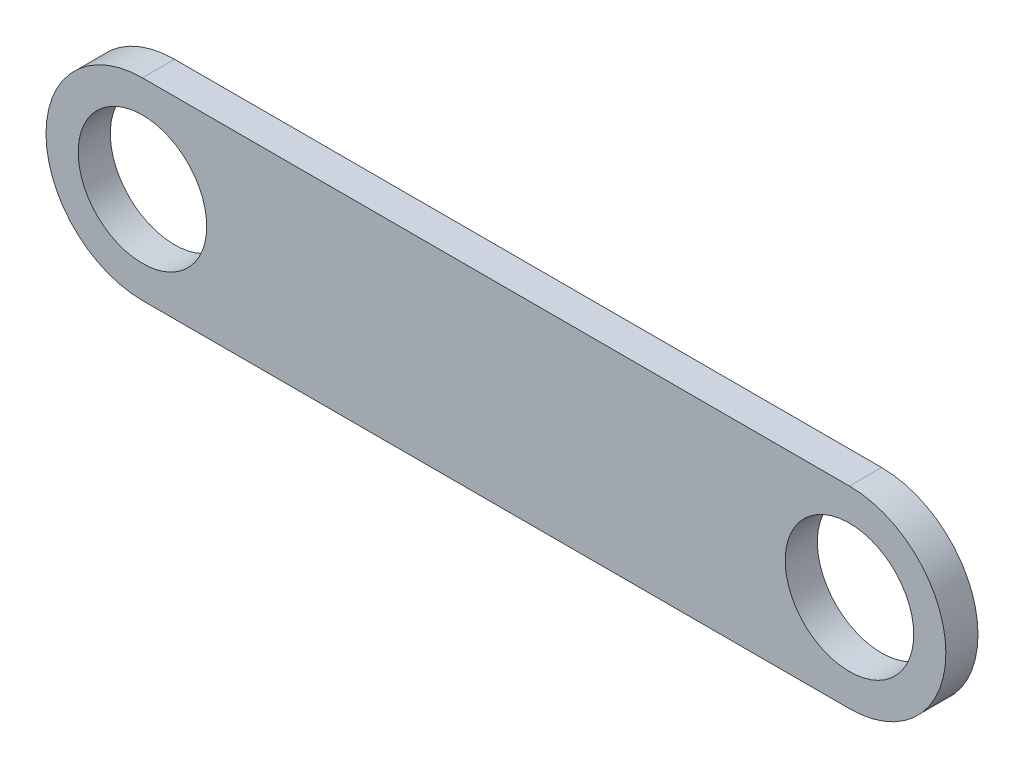
ISO-10303-21;
HEADER;
FILE_DESCRIPTION(('STEP AP214'),'2;1');
FILE_NAME('part.step','',(''),(''),'','','');
FILE_SCHEMA(('AUTOMOTIVE_DESIGN { 1 0 10303 214 1 1 1 1 }'));
ENDSEC;
DATA;
#1=APPLICATION_CONTEXT('core data for automotive mechanical design processes');
#2=APPLICATION_PROTOCOL_DEFINITION('international standard','automotive_design',2000,#1);
#3=PRODUCT_CONTEXT('',#1,'mechanical');
#4=PRODUCT('Part','Part','',(#3));
#5=PRODUCT_RELATED_PRODUCT_CATEGORY('part','',(#4));
#6=PRODUCT_DEFINITION_FORMATION('','',#4);
#7=PRODUCT_DEFINITION_CONTEXT('part definition',#1,'design');
#8=PRODUCT_DEFINITION('design','',#6,#7);
#9=PRODUCT_DEFINITION_SHAPE('','',#8);
#10=(LENGTH_UNIT() NAMED_UNIT(*) SI_UNIT(.MILLI.,.METRE.));
#11=(NAMED_UNIT(*) PLANE_ANGLE_UNIT() SI_UNIT($,.RADIAN.));
#12=(NAMED_UNIT(*) SI_UNIT($,.STERADIAN.) SOLID_ANGLE_UNIT());
#13=UNCERTAINTY_MEASURE_WITH_UNIT(LENGTH_MEASURE(1.E-05),#10,'distance_accuracy_value','');
#14=(GEOMETRIC_REPRESENTATION_CONTEXT(3) GLOBAL_UNCERTAINTY_ASSIGNED_CONTEXT((#13)) GLOBAL_UNIT_ASSIGNED_CONTEXT((#10,
#11,#12)) REPRESENTATION_CONTEXT('',''));
#15=CARTESIAN_POINT('',(0.,0.,0.));
#16=DIRECTION('',(0.,0.,1.));
#17=DIRECTION('',(1.,0.,0.));
#18=AXIS2_PLACEMENT_3D('',#15,#16,#17);
#19=CARTESIAN_POINT('',(-53.125,2.18750000000001,5.));
#20=DIRECTION('',(0.,0.,1.));
#21=DIRECTION('',(1.,0.,0.));
#22=AXIS2_PLACEMENT_3D('',#19,#20,#21);
#23=PLANE('',#22);
#24=CARTESIAN_POINT('',(-53.125,2.18750000000001,5.));
#25=DIRECTION('',(0.,0.,1.));
#26=DIRECTION('',(1.,0.,0.));
#27=AXIS2_PLACEMENT_3D('',#24,#25,#26);
#28=CIRCLE('',#27,10.);
#29=CARTESIAN_POINT('',(-43.125,2.18750000000001,5.));
#30=VERTEX_POINT('',#29);
#31=EDGE_CURVE('E118',#30,#30,#28,.T.);
#32=ORIENTED_EDGE('',*,*,#31,.F.);
#33=EDGE_LOOP('',(#32));
#34=FACE_BOUND('',#33,.T.);
#35=CARTESIAN_POINT('',(-53.125,2.18750000000001,5.));
#36=DIRECTION('',(0.,0.,1.));
#37=DIRECTION('',(1.,0.,0.));
#38=AXIS2_PLACEMENT_3D('',#35,#36,#37);
#39=CIRCLE('',#38,15.);
#40=CARTESIAN_POINT('',(-53.125,17.1875,5.));
#41=VERTEX_POINT('',#40);
#42=CARTESIAN_POINT('',(-53.125,-12.8125,5.));
#43=VERTEX_POINT('',#42);
#44=EDGE_CURVE('E98',#41,#43,#39,.T.);
#45=ORIENTED_EDGE('',*,*,#44,.T.);
#46=DIRECTION('',(1.,0.,0.));
#47=VECTOR('',#46,1.);
#48=CARTESIAN_POINT('',(-53.125,-12.8125,5.));
#49=LINE('',#48,#47);
#50=CARTESIAN_POINT('',(56.875,-12.8125,5.));
#51=VERTEX_POINT('',#50);
#52=EDGE_CURVE('E93',#43,#51,#49,.T.);
#53=ORIENTED_EDGE('',*,*,#52,.T.);
#54=CARTESIAN_POINT('',(56.875,2.18750000000001,5.));
#55=DIRECTION('',(0.,0.,1.));
#56=DIRECTION('',(1.,0.,0.));
#57=AXIS2_PLACEMENT_3D('',#54,#55,#56);
#58=CIRCLE('',#57,15.);
#59=CARTESIAN_POINT('',(56.875,17.1875,5.));
#60=VERTEX_POINT('',#59);
#61=EDGE_CURVE('E96',#51,#60,#58,.T.);
#62=ORIENTED_EDGE('',*,*,#61,.T.);
#63=DIRECTION('',(-1.,0.,0.));
#64=VECTOR('',#63,1.);
#65=CARTESIAN_POINT('',(-53.125,17.1875,5.));
#66=LINE('',#65,#64);
#67=EDGE_CURVE('E63',#60,#41,#66,.T.);
#68=ORIENTED_EDGE('',*,*,#67,.T.);
#69=EDGE_LOOP('',(#45,#53,#62,#68));
#70=FACE_BOUND('',#69,.T.);
#71=CARTESIAN_POINT('',(56.875,2.18750000000001,5.));
#72=DIRECTION('',(0.,0.,1.));
#73=DIRECTION('',(1.,0.,0.));
#74=AXIS2_PLACEMENT_3D('',#71,#72,#73);
#75=CIRCLE('',#74,9.99999999999999);
#76=CARTESIAN_POINT('',(66.875,2.18750000000001,5.));
#77=VERTEX_POINT('',#76);
#78=EDGE_CURVE('E140',#77,#77,#75,.T.);
#79=ORIENTED_EDGE('',*,*,#78,.F.);
#80=EDGE_LOOP('',(#79));
#81=FACE_BOUND('',#80,.T.);
#82=ADVANCED_FACE('F45',(#34,#70,#81),#23,.T.);
#83=CARTESIAN_POINT('',(-53.125,2.18750000000001,0.));
#84=DIRECTION('',(0.,0.,1.));
#85=DIRECTION('',(1.,0.,0.));
#86=AXIS2_PLACEMENT_3D('',#83,#84,#85);
#87=PLANE('',#86);
#88=CARTESIAN_POINT('',(-53.125,2.18750000000001,0.));
#89=DIRECTION('',(0.,0.,1.));
#90=DIRECTION('',(1.,0.,0.));
#91=AXIS2_PLACEMENT_3D('',#88,#89,#90);
#92=CIRCLE('',#91,15.);
#93=CARTESIAN_POINT('',(-53.125,17.1875,0.));
#94=VERTEX_POINT('',#93);
#95=CARTESIAN_POINT('',(-53.125,-12.8125,0.));
#96=VERTEX_POINT('',#95);
#97=EDGE_CURVE('E114',#94,#96,#92,.T.);
#98=ORIENTED_EDGE('',*,*,#97,.F.);
#99=DIRECTION('',(-1.,0.,0.));
#100=VECTOR('',#99,1.);
#101=CARTESIAN_POINT('',(-53.125,17.1875,0.));
#102=LINE('',#101,#100);
#103=CARTESIAN_POINT('',(56.875,17.1875,0.));
#104=VERTEX_POINT('',#103);
#105=EDGE_CURVE('E86',#104,#94,#102,.T.);
#106=ORIENTED_EDGE('',*,*,#105,.F.);
#107=CARTESIAN_POINT('',(56.875,2.18750000000001,0.));
#108=DIRECTION('',(0.,0.,1.));
#109=DIRECTION('',(1.,0.,0.));
#110=AXIS2_PLACEMENT_3D('',#107,#108,#109);
#111=CIRCLE('',#110,15.);
#112=CARTESIAN_POINT('',(56.875,-12.8125,0.));
#113=VERTEX_POINT('',#112);
#114=EDGE_CURVE('E80',#113,#104,#111,.T.);
#115=ORIENTED_EDGE('',*,*,#114,.F.);
#116=DIRECTION('',(1.,0.,0.));
#117=VECTOR('',#116,1.);
#118=CARTESIAN_POINT('',(-53.125,-12.8125,0.));
#119=LINE('',#118,#117);
#120=EDGE_CURVE('E103',#96,#113,#119,.T.);
#121=ORIENTED_EDGE('',*,*,#120,.F.);
#122=EDGE_LOOP('',(#98,#106,#115,#121));
#123=FACE_BOUND('',#122,.T.);
#124=CARTESIAN_POINT('',(-53.125,2.18750000000001,0.));
#125=DIRECTION('',(0.,0.,1.));
#126=DIRECTION('',(1.,0.,0.));
#127=AXIS2_PLACEMENT_3D('',#124,#125,#126);
#128=CIRCLE('',#127,10.);
#129=CARTESIAN_POINT('',(-43.125,2.18750000000001,0.));
#130=VERTEX_POINT('',#129);
#131=EDGE_CURVE('E136',#130,#130,#128,.T.);
#132=ORIENTED_EDGE('',*,*,#131,.T.);
#133=EDGE_LOOP('',(#132));
#134=FACE_BOUND('',#133,.T.);
#135=CARTESIAN_POINT('',(56.875,2.18750000000001,0.));
#136=DIRECTION('',(0.,0.,1.));
#137=DIRECTION('',(1.,0.,0.));
#138=AXIS2_PLACEMENT_3D('',#135,#136,#137);
#139=CIRCLE('',#138,9.99999999999999);
#140=CARTESIAN_POINT('',(66.875,2.18750000000001,0.));
#141=VERTEX_POINT('',#140);
#142=EDGE_CURVE('E144',#141,#141,#139,.T.);
#143=ORIENTED_EDGE('',*,*,#142,.T.);
#144=EDGE_LOOP('',(#143));
#145=FACE_BOUND('',#144,.T.);
#146=ADVANCED_FACE('F131',(#123,#134,#145),#87,.F.);
#147=CARTESIAN_POINT('',(-53.125,2.18750000000001,5.));
#148=DIRECTION('',(0.,0.,-1.));
#149=DIRECTION('',(-1.,0.,0.));
#150=AXIS2_PLACEMENT_3D('',#147,#148,#149);
#151=CYLINDRICAL_SURFACE('',#150,15.);
#152=ORIENTED_EDGE('',*,*,#97,.T.);
#153=DIRECTION('',(0.,0.,-1.));
#154=VECTOR('',#153,1.);
#155=CARTESIAN_POINT('',(-53.125,-12.8125,5.));
#156=LINE('',#155,#154);
#157=EDGE_CURVE('E11',#43,#96,#156,.T.);
#158=ORIENTED_EDGE('',*,*,#157,.F.);
#159=ORIENTED_EDGE('',*,*,#44,.F.);
#160=DIRECTION('',(0.,0.,-1.));
#161=VECTOR('',#160,1.);
#162=CARTESIAN_POINT('',(-53.125,17.1875,5.));
#163=LINE('',#162,#161);
#164=EDGE_CURVE('E110',#41,#94,#163,.T.);
#165=ORIENTED_EDGE('',*,*,#164,.T.);
#166=EDGE_LOOP('',(#152,#158,#159,#165));
#167=FACE_BOUND('',#166,.T.);
#168=ADVANCED_FACE('F47',(#167),#151,.T.);
#169=CARTESIAN_POINT('',(-53.125,-12.8125,5.));
#170=DIRECTION('',(0.,1.,0.));
#171=DIRECTION('',(0.,0.,1.));
#172=AXIS2_PLACEMENT_3D('',#169,#170,#171);
#173=PLANE('',#172);
#174=ORIENTED_EDGE('',*,*,#120,.T.);
#175=DIRECTION('',(0.,0.,-1.));
#176=VECTOR('',#175,1.);
#177=CARTESIAN_POINT('',(56.875,-12.8125,5.));
#178=LINE('',#177,#176);
#179=EDGE_CURVE('E55',#51,#113,#178,.T.);
#180=ORIENTED_EDGE('',*,*,#179,.F.);
#181=ORIENTED_EDGE('',*,*,#52,.F.);
#182=ORIENTED_EDGE('',*,*,#157,.T.);
#183=EDGE_LOOP('',(#174,#180,#181,#182));
#184=FACE_BOUND('',#183,.T.);
#185=ADVANCED_FACE('F102',(#184),#173,.F.);
#186=CARTESIAN_POINT('',(56.875,2.18750000000001,5.));
#187=DIRECTION('',(0.,0.,-1.));
#188=DIRECTION('',(-1.,0.,0.));
#189=AXIS2_PLACEMENT_3D('',#186,#187,#188);
#190=CYLINDRICAL_SURFACE('',#189,15.);
#191=ORIENTED_EDGE('',*,*,#114,.T.);
#192=DIRECTION('',(0.,0.,-1.));
#193=VECTOR('',#192,1.);
#194=CARTESIAN_POINT('',(56.875,17.1875,5.));
#195=LINE('',#194,#193);
#196=EDGE_CURVE('E105',#60,#104,#195,.T.);
#197=ORIENTED_EDGE('',*,*,#196,.F.);
#198=ORIENTED_EDGE('',*,*,#61,.F.);
#199=ORIENTED_EDGE('',*,*,#179,.T.);
#200=EDGE_LOOP('',(#191,#197,#198,#199));
#201=FACE_BOUND('',#200,.T.);
#202=ADVANCED_FACE('F106',(#201),#190,.T.);
#203=CARTESIAN_POINT('',(-53.125,17.1875,5.));
#204=DIRECTION('',(0.,-1.,0.));
#205=DIRECTION('',(0.,0.,-1.));
#206=AXIS2_PLACEMENT_3D('',#203,#204,#205);
#207=PLANE('',#206);
#208=ORIENTED_EDGE('',*,*,#105,.T.);
#209=ORIENTED_EDGE('',*,*,#164,.F.);
#210=ORIENTED_EDGE('',*,*,#67,.F.);
#211=ORIENTED_EDGE('',*,*,#196,.T.);
#212=EDGE_LOOP('',(#208,#209,#210,#211));
#213=FACE_BOUND('',#212,.T.);
#214=ADVANCED_FACE('F128',(#213),#207,.F.);
#215=CARTESIAN_POINT('',(-53.125,2.18750000000001,5.));
#216=DIRECTION('',(0.,0.,-1.));
#217=DIRECTION('',(-1.,0.,0.));
#218=AXIS2_PLACEMENT_3D('',#215,#216,#217);
#219=CYLINDRICAL_SURFACE('',#218,10.);
#220=ORIENTED_EDGE('',*,*,#31,.T.);
#221=EDGE_LOOP('',(#220));
#222=FACE_BOUND('',#221,.T.);
#223=ORIENTED_EDGE('',*,*,#131,.F.);
#224=EDGE_LOOP('',(#223));
#225=FACE_BOUND('',#224,.T.);
#226=ADVANCED_FACE('F163',(#222,#225),#219,.F.);
#227=CARTESIAN_POINT('',(56.875,2.18750000000001,5.));
#228=DIRECTION('',(0.,0.,-1.));
#229=DIRECTION('',(-1.,0.,0.));
#230=AXIS2_PLACEMENT_3D('',#227,#228,#229);
#231=CYLINDRICAL_SURFACE('',#230,9.99999999999999);
#232=ORIENTED_EDGE('',*,*,#78,.T.);
#233=EDGE_LOOP('',(#232));
#234=FACE_BOUND('',#233,.T.);
#235=ORIENTED_EDGE('',*,*,#142,.F.);
#236=EDGE_LOOP('',(#235));
#237=FACE_BOUND('',#236,.T.);
#238=ADVANCED_FACE('F152',(#234,#237),#231,.F.);
#239=CLOSED_SHELL('',(#82,#146,#168,#185,#202,#214,#226,#238));
#240=MANIFOLD_SOLID_BREP('B2',#239);
#241=ADVANCED_BREP_SHAPE_REPRESENTATION('',(#18,#240),#14);
#242=SHAPE_DEFINITION_REPRESENTATION(#9,#241);
ENDSEC;
END-ISO-10303-21;
